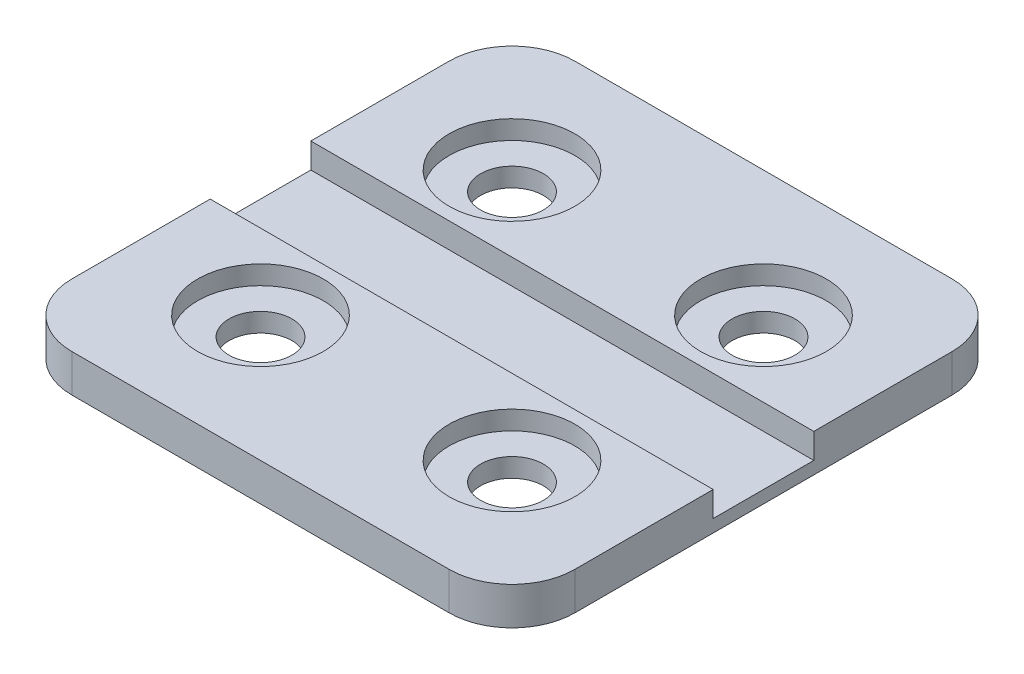
ISO-10303-21;
HEADER;
FILE_DESCRIPTION(('STEP AP214'),'2;1');
FILE_NAME('part.step','',(''),(''),'','','');
FILE_SCHEMA(('AUTOMOTIVE_DESIGN { 1 0 10303 214 1 1 1 1 }'));
ENDSEC;
DATA;
#1=APPLICATION_CONTEXT('core data for automotive mechanical design processes');
#2=APPLICATION_PROTOCOL_DEFINITION('international standard','automotive_design',2000,#1);
#3=PRODUCT_CONTEXT('',#1,'mechanical');
#4=PRODUCT('Part','Part','',(#3));
#5=PRODUCT_RELATED_PRODUCT_CATEGORY('part','',(#4));
#6=PRODUCT_DEFINITION_FORMATION('','',#4);
#7=PRODUCT_DEFINITION_CONTEXT('part definition',#1,'design');
#8=PRODUCT_DEFINITION('design','',#6,#7);
#9=PRODUCT_DEFINITION_SHAPE('','',#8);
#10=(LENGTH_UNIT() NAMED_UNIT(*) SI_UNIT(.MILLI.,.METRE.));
#11=(NAMED_UNIT(*) PLANE_ANGLE_UNIT() SI_UNIT($,.RADIAN.));
#12=(NAMED_UNIT(*) SI_UNIT($,.STERADIAN.) SOLID_ANGLE_UNIT());
#13=UNCERTAINTY_MEASURE_WITH_UNIT(LENGTH_MEASURE(1.E-05),#10,'distance_accuracy_value','');
#14=(GEOMETRIC_REPRESENTATION_CONTEXT(3) GLOBAL_UNCERTAINTY_ASSIGNED_CONTEXT((#13)) GLOBAL_UNIT_ASSIGNED_CONTEXT((#10,
#11,#12)) REPRESENTATION_CONTEXT('',''));
#15=CARTESIAN_POINT('',(0.,0.,0.));
#16=DIRECTION('',(0.,0.,1.));
#17=DIRECTION('',(1.,0.,0.));
#18=AXIS2_PLACEMENT_3D('',#15,#16,#17);
#19=CARTESIAN_POINT('',(0.,3.,0.));
#20=DIRECTION('',(0.,-1.,0.));
#21=DIRECTION('',(0.,0.,-1.));
#22=AXIS2_PLACEMENT_3D('',#19,#20,#21);
#23=PLANE('',#22);
#24=CARTESIAN_POINT('',(10.,3.,10.));
#25=DIRECTION('',(0.,1.,0.));
#26=DIRECTION('',(0.,0.,1.));
#27=AXIS2_PLACEMENT_3D('',#24,#25,#26);
#28=CIRCLE('',#27,5.);
#29=CARTESIAN_POINT('',(10.,3.,15.));
#30=VERTEX_POINT('',#29);
#31=EDGE_CURVE('E200',#30,#30,#28,.T.);
#32=ORIENTED_EDGE('',*,*,#31,.F.);
#33=EDGE_LOOP('',(#32));
#34=FACE_BOUND('',#33,.T.);
#35=CARTESIAN_POINT('',(-10.,3.,10.));
#36=DIRECTION('',(0.,1.,0.));
#37=DIRECTION('',(0.,0.,1.));
#38=AXIS2_PLACEMENT_3D('',#35,#36,#37);
#39=CIRCLE('',#38,5.);
#40=CARTESIAN_POINT('',(-10.,3.,15.));
#41=VERTEX_POINT('',#40);
#42=EDGE_CURVE('E208',#41,#41,#39,.T.);
#43=ORIENTED_EDGE('',*,*,#42,.F.);
#44=EDGE_LOOP('',(#43));
#45=FACE_BOUND('',#44,.T.);
#46=DIRECTION('',(0.,0.,-1.));
#47=VECTOR('',#46,1.);
#48=CARTESIAN_POINT('',(20.,3.,20.));
#49=LINE('',#48,#47);
#50=CARTESIAN_POINT('',(20.,3.,15.));
#51=VERTEX_POINT('',#50);
#52=CARTESIAN_POINT('',(20.,3.,4.));
#53=VERTEX_POINT('',#52);
#54=EDGE_CURVE('E236',#51,#53,#49,.T.);
#55=ORIENTED_EDGE('',*,*,#54,.T.);
#56=DIRECTION('',(1.,0.,0.));
#57=VECTOR('',#56,1.);
#58=CARTESIAN_POINT('',(-20.,3.,4.));
#59=LINE('',#58,#57);
#60=CARTESIAN_POINT('',(-20.,3.,4.));
#61=VERTEX_POINT('',#60);
#62=EDGE_CURVE('E136',#61,#53,#59,.T.);
#63=ORIENTED_EDGE('',*,*,#62,.F.);
#64=DIRECTION('',(0.,0.,1.));
#65=VECTOR('',#64,1.);
#66=CARTESIAN_POINT('',(-20.,3.,20.));
#67=LINE('',#66,#65);
#68=CARTESIAN_POINT('',(-20.,3.,15.));
#69=VERTEX_POINT('',#68);
#70=EDGE_CURVE('E243',#61,#69,#67,.T.);
#71=ORIENTED_EDGE('',*,*,#70,.T.);
#72=CARTESIAN_POINT('',(-15.,3.,15.));
#73=DIRECTION('',(0.,-1.,0.));
#74=DIRECTION('',(0.,0.,-1.));
#75=AXIS2_PLACEMENT_3D('',#72,#73,#74);
#76=CIRCLE('',#75,5.);
#77=CARTESIAN_POINT('',(-15.,3.,20.));
#78=VERTEX_POINT('',#77);
#79=EDGE_CURVE('E302',#69,#78,#76,.F.);
#80=ORIENTED_EDGE('',*,*,#79,.T.);
#81=DIRECTION('',(1.,0.,0.));
#82=VECTOR('',#81,1.);
#83=CARTESIAN_POINT('',(-20.,3.,20.));
#84=LINE('',#83,#82);
#85=CARTESIAN_POINT('',(15.,3.,20.));
#86=VERTEX_POINT('',#85);
#87=EDGE_CURVE('E248',#78,#86,#84,.T.);
#88=ORIENTED_EDGE('',*,*,#87,.T.);
#89=CARTESIAN_POINT('',(15.,3.,15.));
#90=DIRECTION('',(0.,-1.,0.));
#91=DIRECTION('',(0.,0.,-1.));
#92=AXIS2_PLACEMENT_3D('',#89,#90,#91);
#93=CIRCLE('',#92,5.);
#94=EDGE_CURVE('E299',#86,#51,#93,.F.);
#95=ORIENTED_EDGE('',*,*,#94,.T.);
#96=EDGE_LOOP('',(#55,#63,#71,#80,#88,#95));
#97=FACE_BOUND('',#96,.T.);
#98=ADVANCED_FACE('F40',(#34,#45,#97),#23,.F.);
#99=CARTESIAN_POINT('',(20.,3.,20.));
#100=DIRECTION('',(-1.,0.,0.));
#101=DIRECTION('',(0.,0.,1.));
#102=AXIS2_PLACEMENT_3D('',#99,#100,#101);
#103=PLANE('',#102);
#104=DIRECTION('',(0.,0.,-1.));
#105=VECTOR('',#104,1.);
#106=CARTESIAN_POINT('',(20.,1.,-4.));
#107=LINE('',#106,#105);
#108=CARTESIAN_POINT('',(20.,1.,4.));
#109=VERTEX_POINT('',#108);
#110=CARTESIAN_POINT('',(20.,1.,-4.));
#111=VERTEX_POINT('',#110);
#112=EDGE_CURVE('E142',#109,#111,#107,.T.);
#113=ORIENTED_EDGE('',*,*,#112,.F.);
#114=DIRECTION('',(0.,1.,0.));
#115=VECTOR('',#114,1.);
#116=CARTESIAN_POINT('',(20.,-40.7921561087423,4.));
#117=LINE('',#116,#115);
#118=EDGE_CURVE('E130',#109,#53,#117,.T.);
#119=ORIENTED_EDGE('',*,*,#118,.T.);
#120=ORIENTED_EDGE('',*,*,#54,.F.);
#121=DIRECTION('',(0.,-1.,0.));
#122=VECTOR('',#121,1.);
#123=CARTESIAN_POINT('',(20.,3.,15.));
#124=LINE('',#123,#122);
#125=CARTESIAN_POINT('',(20.,0.,15.));
#126=VERTEX_POINT('',#125);
#127=EDGE_CURVE('E309',#51,#126,#124,.T.);
#128=ORIENTED_EDGE('',*,*,#127,.T.);
#129=DIRECTION('',(0.,0.,-1.));
#130=VECTOR('',#129,1.);
#131=CARTESIAN_POINT('',(20.,0.,20.));
#132=LINE('',#131,#130);
#133=CARTESIAN_POINT('',(20.,0.,-15.));
#134=VERTEX_POINT('',#133);
#135=EDGE_CURVE('E232',#126,#134,#132,.T.);
#136=ORIENTED_EDGE('',*,*,#135,.T.);
#137=DIRECTION('',(0.,-1.,0.));
#138=VECTOR('',#137,1.);
#139=CARTESIAN_POINT('',(20.,3.,-15.));
#140=LINE('',#139,#138);
#141=CARTESIAN_POINT('',(20.,3.,-15.));
#142=VERTEX_POINT('',#141);
#143=EDGE_CURVE('E305',#134,#142,#140,.F.);
#144=ORIENTED_EDGE('',*,*,#143,.T.);
#145=CARTESIAN_POINT('',(20.,3.,-4.));
#146=VERTEX_POINT('',#145);
#147=EDGE_CURVE('E240',#146,#142,#49,.T.);
#148=ORIENTED_EDGE('',*,*,#147,.F.);
#149=DIRECTION('',(0.,1.,0.));
#150=VECTOR('',#149,1.);
#151=CARTESIAN_POINT('',(20.,-40.7921561087423,-4.));
#152=LINE('',#151,#150);
#153=EDGE_CURVE('E56',#111,#146,#152,.T.);
#154=ORIENTED_EDGE('',*,*,#153,.F.);
#155=EDGE_LOOP('',(#113,#119,#120,#128,#136,#144,#148,#154));
#156=FACE_BOUND('',#155,.T.);
#157=ADVANCED_FACE('F154',(#156),#103,.F.);
#158=CARTESIAN_POINT('',(-20.,3.,-20.));
#159=DIRECTION('',(0.,0.,1.));
#160=DIRECTION('',(1.,0.,0.));
#161=AXIS2_PLACEMENT_3D('',#158,#159,#160);
#162=PLANE('',#161);
#163=DIRECTION('',(-1.,0.,0.));
#164=VECTOR('',#163,1.);
#165=CARTESIAN_POINT('',(-20.,3.,-20.));
#166=LINE('',#165,#164);
#167=CARTESIAN_POINT('',(15.,3.,-20.));
#168=VERTEX_POINT('',#167);
#169=CARTESIAN_POINT('',(-15.,3.,-20.));
#170=VERTEX_POINT('',#169);
#171=EDGE_CURVE('E239',#168,#170,#166,.T.);
#172=ORIENTED_EDGE('',*,*,#171,.F.);
#173=DIRECTION('',(0.,-1.,0.));
#174=VECTOR('',#173,1.);
#175=CARTESIAN_POINT('',(15.,3.,-20.));
#176=LINE('',#175,#174);
#177=CARTESIAN_POINT('',(15.,0.,-20.));
#178=VERTEX_POINT('',#177);
#179=EDGE_CURVE('E12',#168,#178,#176,.T.);
#180=ORIENTED_EDGE('',*,*,#179,.T.);
#181=DIRECTION('',(-1.,0.,0.));
#182=VECTOR('',#181,1.);
#183=CARTESIAN_POINT('',(-20.,0.,-20.));
#184=LINE('',#183,#182);
#185=CARTESIAN_POINT('',(-15.,0.,-20.));
#186=VERTEX_POINT('',#185);
#187=EDGE_CURVE('E256',#178,#186,#184,.T.);
#188=ORIENTED_EDGE('',*,*,#187,.T.);
#189=DIRECTION('',(0.,-1.,0.));
#190=VECTOR('',#189,1.);
#191=CARTESIAN_POINT('',(-15.,3.,-20.));
#192=LINE('',#191,#190);
#193=EDGE_CURVE('E49',#186,#170,#192,.F.);
#194=ORIENTED_EDGE('',*,*,#193,.T.);
#195=EDGE_LOOP('',(#172,#180,#188,#194));
#196=FACE_BOUND('',#195,.T.);
#197=ADVANCED_FACE('F336',(#196),#162,.F.);
#198=CARTESIAN_POINT('',(-20.,3.,20.));
#199=DIRECTION('',(1.,0.,0.));
#200=DIRECTION('',(0.,0.,-1.));
#201=AXIS2_PLACEMENT_3D('',#198,#199,#200);
#202=PLANE('',#201);
#203=ORIENTED_EDGE('',*,*,#70,.F.);
#204=DIRECTION('',(0.,1.,0.));
#205=VECTOR('',#204,1.);
#206=CARTESIAN_POINT('',(-20.,-40.7921561087423,4.));
#207=LINE('',#206,#205);
#208=CARTESIAN_POINT('',(-20.,1.,4.));
#209=VERTEX_POINT('',#208);
#210=EDGE_CURVE('E168',#209,#61,#207,.T.);
#211=ORIENTED_EDGE('',*,*,#210,.F.);
#212=DIRECTION('',(0.,0.,1.));
#213=VECTOR('',#212,1.);
#214=CARTESIAN_POINT('',(-20.,1.,-4.));
#215=LINE('',#214,#213);
#216=CARTESIAN_POINT('',(-20.,1.,-4.));
#217=VERTEX_POINT('',#216);
#218=EDGE_CURVE('E149',#217,#209,#215,.T.);
#219=ORIENTED_EDGE('',*,*,#218,.F.);
#220=DIRECTION('',(0.,1.,0.));
#221=VECTOR('',#220,1.);
#222=CARTESIAN_POINT('',(-20.,-40.7921561087423,-4.));
#223=LINE('',#222,#221);
#224=CARTESIAN_POINT('',(-20.,3.,-4.));
#225=VERTEX_POINT('',#224);
#226=EDGE_CURVE('E164',#217,#225,#223,.T.);
#227=ORIENTED_EDGE('',*,*,#226,.T.);
#228=CARTESIAN_POINT('',(-20.,3.,-15.));
#229=VERTEX_POINT('',#228);
#230=EDGE_CURVE('E244',#229,#225,#67,.T.);
#231=ORIENTED_EDGE('',*,*,#230,.F.);
#232=DIRECTION('',(0.,-1.,0.));
#233=VECTOR('',#232,1.);
#234=CARTESIAN_POINT('',(-20.,3.,-15.));
#235=LINE('',#234,#233);
#236=CARTESIAN_POINT('',(-20.,0.,-15.));
#237=VERTEX_POINT('',#236);
#238=EDGE_CURVE('E285',#229,#237,#235,.T.);
#239=ORIENTED_EDGE('',*,*,#238,.T.);
#240=DIRECTION('',(0.,0.,1.));
#241=VECTOR('',#240,1.);
#242=CARTESIAN_POINT('',(-20.,0.,20.));
#243=LINE('',#242,#241);
#244=CARTESIAN_POINT('',(-20.,0.,15.));
#245=VERTEX_POINT('',#244);
#246=EDGE_CURVE('E259',#237,#245,#243,.T.);
#247=ORIENTED_EDGE('',*,*,#246,.T.);
#248=DIRECTION('',(0.,-1.,0.));
#249=VECTOR('',#248,1.);
#250=CARTESIAN_POINT('',(-20.,3.,15.));
#251=LINE('',#250,#249);
#252=EDGE_CURVE('E289',#245,#69,#251,.F.);
#253=ORIENTED_EDGE('',*,*,#252,.T.);
#254=EDGE_LOOP('',(#203,#211,#219,#227,#231,#239,#247,#253));
#255=FACE_BOUND('',#254,.T.);
#256=ADVANCED_FACE('F319',(#255),#202,.F.);
#257=CARTESIAN_POINT('',(-20.,3.,20.));
#258=DIRECTION('',(0.,0.,-1.));
#259=DIRECTION('',(-1.,0.,0.));
#260=AXIS2_PLACEMENT_3D('',#257,#258,#259);
#261=PLANE('',#260);
#262=ORIENTED_EDGE('',*,*,#87,.F.);
#263=DIRECTION('',(0.,-1.,0.));
#264=VECTOR('',#263,1.);
#265=CARTESIAN_POINT('',(-15.,3.,20.));
#266=LINE('',#265,#264);
#267=CARTESIAN_POINT('',(-15.,0.,20.));
#268=VERTEX_POINT('',#267);
#269=EDGE_CURVE('E269',#78,#268,#266,.T.);
#270=ORIENTED_EDGE('',*,*,#269,.T.);
#271=DIRECTION('',(1.,0.,0.));
#272=VECTOR('',#271,1.);
#273=CARTESIAN_POINT('',(-20.,0.,20.));
#274=LINE('',#273,#272);
#275=CARTESIAN_POINT('',(15.,0.,20.));
#276=VERTEX_POINT('',#275);
#277=EDGE_CURVE('E263',#268,#276,#274,.T.);
#278=ORIENTED_EDGE('',*,*,#277,.T.);
#279=DIRECTION('',(0.,-1.,0.));
#280=VECTOR('',#279,1.);
#281=CARTESIAN_POINT('',(15.,3.,20.));
#282=LINE('',#281,#280);
#283=EDGE_CURVE('E252',#276,#86,#282,.F.);
#284=ORIENTED_EDGE('',*,*,#283,.T.);
#285=EDGE_LOOP('',(#262,#270,#278,#284));
#286=FACE_BOUND('',#285,.T.);
#287=ADVANCED_FACE('F352',(#286),#261,.F.);
#288=CARTESIAN_POINT('',(10.,3.,-10.));
#289=DIRECTION('',(0.,1.,0.));
#290=DIRECTION('',(0.,0.,1.));
#291=AXIS2_PLACEMENT_3D('',#288,#289,#290);
#292=CIRCLE('',#291,5.);
#293=CARTESIAN_POINT('',(10.,3.,-5.));
#294=VERTEX_POINT('',#293);
#295=EDGE_CURVE('E217',#294,#294,#292,.T.);
#296=ORIENTED_EDGE('',*,*,#295,.F.);
#297=EDGE_LOOP('',(#296));
#298=FACE_BOUND('',#297,.T.);
#299=CARTESIAN_POINT('',(-10.,3.,-10.));
#300=DIRECTION('',(0.,1.,0.));
#301=DIRECTION('',(0.,0.,1.));
#302=AXIS2_PLACEMENT_3D('',#299,#300,#301);
#303=CIRCLE('',#302,5.);
#304=CARTESIAN_POINT('',(-10.,3.,-5.));
#305=VERTEX_POINT('',#304);
#306=EDGE_CURVE('E216',#305,#305,#303,.T.);
#307=ORIENTED_EDGE('',*,*,#306,.F.);
#308=EDGE_LOOP('',(#307));
#309=FACE_BOUND('',#308,.T.);
#310=ORIENTED_EDGE('',*,*,#230,.T.);
#311=DIRECTION('',(-1.,0.,0.));
#312=VECTOR('',#311,1.);
#313=CARTESIAN_POINT('',(-20.,3.,-4.));
#314=LINE('',#313,#312);
#315=EDGE_CURVE('E152',#146,#225,#314,.T.);
#316=ORIENTED_EDGE('',*,*,#315,.F.);
#317=ORIENTED_EDGE('',*,*,#147,.T.);
#318=CARTESIAN_POINT('',(15.,3.,-15.));
#319=DIRECTION('',(0.,-1.,0.));
#320=DIRECTION('',(0.,0.,-1.));
#321=AXIS2_PLACEMENT_3D('',#318,#319,#320);
#322=CIRCLE('',#321,5.);
#323=EDGE_CURVE('E296',#142,#168,#322,.F.);
#324=ORIENTED_EDGE('',*,*,#323,.T.);
#325=ORIENTED_EDGE('',*,*,#171,.T.);
#326=CARTESIAN_POINT('',(-15.,3.,-15.));
#327=DIRECTION('',(0.,-1.,0.));
#328=DIRECTION('',(0.,0.,-1.));
#329=AXIS2_PLACEMENT_3D('',#326,#327,#328);
#330=CIRCLE('',#329,5.);
#331=EDGE_CURVE('E293',#170,#229,#330,.F.);
#332=ORIENTED_EDGE('',*,*,#331,.T.);
#333=EDGE_LOOP('',(#310,#316,#317,#324,#325,#332));
#334=FACE_BOUND('',#333,.T.);
#335=ADVANCED_FACE('F328',(#298,#309,#334),#23,.F.);
#336=CARTESIAN_POINT('',(0.,0.,0.));
#337=DIRECTION('',(0.,-1.,0.));
#338=DIRECTION('',(0.,0.,-1.));
#339=AXIS2_PLACEMENT_3D('',#336,#337,#338);
#340=PLANE('',#339);
#341=CARTESIAN_POINT('',(10.,0.,-10.));
#342=DIRECTION('',(0.,1.,0.));
#343=DIRECTION('',(0.,0.,1.));
#344=AXIS2_PLACEMENT_3D('',#341,#342,#343);
#345=CIRCLE('',#344,2.5);
#346=CARTESIAN_POINT('',(10.,0.,-7.5));
#347=VERTEX_POINT('',#346);
#348=EDGE_CURVE('E180',#347,#347,#345,.T.);
#349=ORIENTED_EDGE('',*,*,#348,.T.);
#350=EDGE_LOOP('',(#349));
#351=FACE_BOUND('',#350,.T.);
#352=CARTESIAN_POINT('',(-10.,0.,10.));
#353=DIRECTION('',(0.,1.,0.));
#354=DIRECTION('',(0.,0.,1.));
#355=AXIS2_PLACEMENT_3D('',#352,#353,#354);
#356=CIRCLE('',#355,2.5);
#357=CARTESIAN_POINT('',(-10.,0.,12.5));
#358=VERTEX_POINT('',#357);
#359=EDGE_CURVE('E189',#358,#358,#356,.T.);
#360=ORIENTED_EDGE('',*,*,#359,.T.);
#361=EDGE_LOOP('',(#360));
#362=FACE_BOUND('',#361,.T.);
#363=CARTESIAN_POINT('',(10.,0.,10.));
#364=DIRECTION('',(0.,1.,0.));
#365=DIRECTION('',(0.,0.,1.));
#366=AXIS2_PLACEMENT_3D('',#363,#364,#365);
#367=CIRCLE('',#366,2.5);
#368=CARTESIAN_POINT('',(10.,0.,12.5));
#369=VERTEX_POINT('',#368);
#370=EDGE_CURVE('E172',#369,#369,#367,.T.);
#371=ORIENTED_EDGE('',*,*,#370,.T.);
#372=EDGE_LOOP('',(#371));
#373=FACE_BOUND('',#372,.T.);
#374=CARTESIAN_POINT('',(-10.,0.,-10.));
#375=DIRECTION('',(0.,1.,0.));
#376=DIRECTION('',(0.,0.,1.));
#377=AXIS2_PLACEMENT_3D('',#374,#375,#376);
#378=CIRCLE('',#377,2.5);
#379=CARTESIAN_POINT('',(-10.,0.,-7.5));
#380=VERTEX_POINT('',#379);
#381=EDGE_CURVE('E196',#380,#380,#378,.T.);
#382=ORIENTED_EDGE('',*,*,#381,.T.);
#383=EDGE_LOOP('',(#382));
#384=FACE_BOUND('',#383,.T.);
#385=ORIENTED_EDGE('',*,*,#277,.F.);
#386=CARTESIAN_POINT('',(-15.,0.,15.));
#387=DIRECTION('',(0.,-1.,0.));
#388=DIRECTION('',(0.,0.,-1.));
#389=AXIS2_PLACEMENT_3D('',#386,#387,#388);
#390=CIRCLE('',#389,5.);
#391=EDGE_CURVE('E282',#268,#245,#390,.T.);
#392=ORIENTED_EDGE('',*,*,#391,.T.);
#393=ORIENTED_EDGE('',*,*,#246,.F.);
#394=CARTESIAN_POINT('',(-15.,0.,-15.));
#395=DIRECTION('',(0.,-1.,0.));
#396=DIRECTION('',(0.,0.,-1.));
#397=AXIS2_PLACEMENT_3D('',#394,#395,#396);
#398=CIRCLE('',#397,5.);
#399=EDGE_CURVE('E273',#237,#186,#398,.T.);
#400=ORIENTED_EDGE('',*,*,#399,.T.);
#401=ORIENTED_EDGE('',*,*,#187,.F.);
#402=CARTESIAN_POINT('',(15.,0.,-15.));
#403=DIRECTION('',(0.,-1.,0.));
#404=DIRECTION('',(0.,0.,-1.));
#405=AXIS2_PLACEMENT_3D('',#402,#403,#404);
#406=CIRCLE('',#405,5.);
#407=EDGE_CURVE('E276',#178,#134,#406,.T.);
#408=ORIENTED_EDGE('',*,*,#407,.T.);
#409=ORIENTED_EDGE('',*,*,#135,.F.);
#410=CARTESIAN_POINT('',(15.,0.,15.));
#411=DIRECTION('',(0.,-1.,0.));
#412=DIRECTION('',(0.,0.,-1.));
#413=AXIS2_PLACEMENT_3D('',#410,#411,#412);
#414=CIRCLE('',#413,5.);
#415=EDGE_CURVE('E279',#126,#276,#414,.T.);
#416=ORIENTED_EDGE('',*,*,#415,.T.);
#417=EDGE_LOOP('',(#385,#392,#393,#400,#401,#408,#409,#416));
#418=FACE_BOUND('',#417,.T.);
#419=ADVANCED_FACE('F340',(#351,#362,#373,#384,#418),#340,.T.);
#420=CARTESIAN_POINT('',(-10.,1.5,-10.));
#421=DIRECTION('',(0.,1.,0.));
#422=DIRECTION('',(0.,0.,1.));
#423=AXIS2_PLACEMENT_3D('',#420,#421,#422);
#424=CYLINDRICAL_SURFACE('',#423,5.);
#425=CARTESIAN_POINT('',(-10.,1.5,-10.));
#426=DIRECTION('',(0.,1.,0.));
#427=DIRECTION('',(0.,0.,1.));
#428=AXIS2_PLACEMENT_3D('',#425,#426,#427);
#429=CIRCLE('',#428,5.);
#430=CARTESIAN_POINT('',(-10.,1.5,-5.));
#431=VERTEX_POINT('',#430);
#432=EDGE_CURVE('E228',#431,#431,#429,.T.);
#433=ORIENTED_EDGE('',*,*,#432,.F.);
#434=EDGE_LOOP('',(#433));
#435=FACE_BOUND('',#434,.T.);
#436=ORIENTED_EDGE('',*,*,#306,.T.);
#437=EDGE_LOOP('',(#436));
#438=FACE_BOUND('',#437,.T.);
#439=ADVANCED_FACE('F384',(#435,#438),#424,.F.);
#440=CARTESIAN_POINT('',(0.,1.5,0.));
#441=DIRECTION('',(0.,1.,0.));
#442=DIRECTION('',(0.,0.,1.));
#443=AXIS2_PLACEMENT_3D('',#440,#441,#442);
#444=PLANE('',#443);
#445=CARTESIAN_POINT('',(-10.,1.5,-10.));
#446=DIRECTION('',(0.,1.,0.));
#447=DIRECTION('',(0.,0.,1.));
#448=AXIS2_PLACEMENT_3D('',#445,#446,#447);
#449=CIRCLE('',#448,2.5);
#450=CARTESIAN_POINT('',(-10.,1.5,-7.5));
#451=VERTEX_POINT('',#450);
#452=EDGE_CURVE('E184',#451,#451,#449,.T.);
#453=ORIENTED_EDGE('',*,*,#452,.F.);
#454=EDGE_LOOP('',(#453));
#455=FACE_BOUND('',#454,.T.);
#456=ORIENTED_EDGE('',*,*,#432,.T.);
#457=EDGE_LOOP('',(#456));
#458=FACE_BOUND('',#457,.T.);
#459=ADVANCED_FACE('F393',(#455,#458),#444,.T.);
#460=CARTESIAN_POINT('',(10.,1.5,10.));
#461=DIRECTION('',(0.,1.,0.));
#462=DIRECTION('',(0.,0.,1.));
#463=AXIS2_PLACEMENT_3D('',#460,#461,#462);
#464=CYLINDRICAL_SURFACE('',#463,5.);
#465=CARTESIAN_POINT('',(10.,1.5,10.));
#466=DIRECTION('',(0.,1.,0.));
#467=DIRECTION('',(0.,0.,1.));
#468=AXIS2_PLACEMENT_3D('',#465,#466,#467);
#469=CIRCLE('',#468,5.);
#470=CARTESIAN_POINT('',(10.,1.5,15.));
#471=VERTEX_POINT('',#470);
#472=EDGE_CURVE('E204',#471,#471,#469,.T.);
#473=ORIENTED_EDGE('',*,*,#472,.F.);
#474=EDGE_LOOP('',(#473));
#475=FACE_BOUND('',#474,.T.);
#476=ORIENTED_EDGE('',*,*,#31,.T.);
#477=EDGE_LOOP('',(#476));
#478=FACE_BOUND('',#477,.T.);
#479=ADVANCED_FACE('F398',(#475,#478),#464,.F.);
#480=CARTESIAN_POINT('',(0.,1.5,0.));
#481=DIRECTION('',(0.,1.,0.));
#482=DIRECTION('',(0.,0.,1.));
#483=AXIS2_PLACEMENT_3D('',#480,#481,#482);
#484=PLANE('',#483);
#485=CARTESIAN_POINT('',(10.,1.5,10.));
#486=DIRECTION('',(0.,1.,0.));
#487=DIRECTION('',(0.,0.,1.));
#488=AXIS2_PLACEMENT_3D('',#485,#486,#487);
#489=CIRCLE('',#488,2.5);
#490=CARTESIAN_POINT('',(10.,1.5,12.5));
#491=VERTEX_POINT('',#490);
#492=EDGE_CURVE('E171',#491,#491,#489,.T.);
#493=ORIENTED_EDGE('',*,*,#492,.F.);
#494=EDGE_LOOP('',(#493));
#495=FACE_BOUND('',#494,.T.);
#496=ORIENTED_EDGE('',*,*,#472,.T.);
#497=EDGE_LOOP('',(#496));
#498=FACE_BOUND('',#497,.T.);
#499=ADVANCED_FACE('F407',(#495,#498),#484,.T.);
#500=CARTESIAN_POINT('',(-10.,1.5,10.));
#501=DIRECTION('',(0.,1.,0.));
#502=DIRECTION('',(0.,0.,1.));
#503=AXIS2_PLACEMENT_3D('',#500,#501,#502);
#504=CYLINDRICAL_SURFACE('',#503,5.);
#505=CARTESIAN_POINT('',(-10.,1.5,10.));
#506=DIRECTION('',(0.,1.,0.));
#507=DIRECTION('',(0.,0.,1.));
#508=AXIS2_PLACEMENT_3D('',#505,#506,#507);
#509=CIRCLE('',#508,5.);
#510=CARTESIAN_POINT('',(-10.,1.5,15.));
#511=VERTEX_POINT('',#510);
#512=EDGE_CURVE('E221',#511,#511,#509,.T.);
#513=ORIENTED_EDGE('',*,*,#512,.F.);
#514=EDGE_LOOP('',(#513));
#515=FACE_BOUND('',#514,.T.);
#516=ORIENTED_EDGE('',*,*,#42,.T.);
#517=EDGE_LOOP('',(#516));
#518=FACE_BOUND('',#517,.T.);
#519=ADVANCED_FACE('F403',(#515,#518),#504,.F.);
#520=CARTESIAN_POINT('',(0.,1.5,0.));
#521=DIRECTION('',(0.,1.,0.));
#522=DIRECTION('',(0.,0.,1.));
#523=AXIS2_PLACEMENT_3D('',#520,#521,#522);
#524=PLANE('',#523);
#525=CARTESIAN_POINT('',(-10.,1.5,10.));
#526=DIRECTION('',(0.,1.,0.));
#527=DIRECTION('',(0.,0.,1.));
#528=AXIS2_PLACEMENT_3D('',#525,#526,#527);
#529=CIRCLE('',#528,2.5);
#530=CARTESIAN_POINT('',(-10.,1.5,12.5));
#531=VERTEX_POINT('',#530);
#532=EDGE_CURVE('E176',#531,#531,#529,.T.);
#533=ORIENTED_EDGE('',*,*,#532,.F.);
#534=EDGE_LOOP('',(#533));
#535=FACE_BOUND('',#534,.T.);
#536=ORIENTED_EDGE('',*,*,#512,.T.);
#537=EDGE_LOOP('',(#536));
#538=FACE_BOUND('',#537,.T.);
#539=ADVANCED_FACE('F406',(#535,#538),#524,.T.);
#540=CARTESIAN_POINT('',(10.,1.5,-10.));
#541=DIRECTION('',(0.,1.,0.));
#542=DIRECTION('',(0.,0.,1.));
#543=AXIS2_PLACEMENT_3D('',#540,#541,#542);
#544=CYLINDRICAL_SURFACE('',#543,5.);
#545=CARTESIAN_POINT('',(10.,1.5,-10.));
#546=DIRECTION('',(0.,1.,0.));
#547=DIRECTION('',(0.,0.,1.));
#548=AXIS2_PLACEMENT_3D('',#545,#546,#547);
#549=CIRCLE('',#548,5.);
#550=CARTESIAN_POINT('',(10.,1.5,-5.));
#551=VERTEX_POINT('',#550);
#552=EDGE_CURVE('E212',#551,#551,#549,.T.);
#553=ORIENTED_EDGE('',*,*,#552,.F.);
#554=EDGE_LOOP('',(#553));
#555=FACE_BOUND('',#554,.T.);
#556=ORIENTED_EDGE('',*,*,#295,.T.);
#557=EDGE_LOOP('',(#556));
#558=FACE_BOUND('',#557,.T.);
#559=ADVANCED_FACE('F411',(#555,#558),#544,.F.);
#560=CARTESIAN_POINT('',(0.,1.5,0.));
#561=DIRECTION('',(0.,1.,0.));
#562=DIRECTION('',(0.,0.,1.));
#563=AXIS2_PLACEMENT_3D('',#560,#561,#562);
#564=PLANE('',#563);
#565=CARTESIAN_POINT('',(10.,1.5,-10.));
#566=DIRECTION('',(0.,1.,0.));
#567=DIRECTION('',(0.,0.,1.));
#568=AXIS2_PLACEMENT_3D('',#565,#566,#567);
#569=CIRCLE('',#568,2.5);
#570=CARTESIAN_POINT('',(10.,1.5,-7.5));
#571=VERTEX_POINT('',#570);
#572=EDGE_CURVE('E185',#571,#571,#569,.T.);
#573=ORIENTED_EDGE('',*,*,#572,.F.);
#574=EDGE_LOOP('',(#573));
#575=FACE_BOUND('',#574,.T.);
#576=ORIENTED_EDGE('',*,*,#552,.T.);
#577=EDGE_LOOP('',(#576));
#578=FACE_BOUND('',#577,.T.);
#579=ADVANCED_FACE('F415',(#575,#578),#564,.T.);
#580=CARTESIAN_POINT('',(-10.,0.,-10.));
#581=DIRECTION('',(0.,1.,0.));
#582=DIRECTION('',(0.,0.,1.));
#583=AXIS2_PLACEMENT_3D('',#580,#581,#582);
#584=CYLINDRICAL_SURFACE('',#583,2.5);
#585=ORIENTED_EDGE('',*,*,#381,.F.);
#586=EDGE_LOOP('',(#585));
#587=FACE_BOUND('',#586,.T.);
#588=ORIENTED_EDGE('',*,*,#452,.T.);
#589=EDGE_LOOP('',(#588));
#590=FACE_BOUND('',#589,.T.);
#591=ADVANCED_FACE('F419',(#587,#590),#584,.F.);
#592=CARTESIAN_POINT('',(10.,0.,10.));
#593=DIRECTION('',(0.,1.,0.));
#594=DIRECTION('',(0.,0.,1.));
#595=AXIS2_PLACEMENT_3D('',#592,#593,#594);
#596=CYLINDRICAL_SURFACE('',#595,2.5);
#597=ORIENTED_EDGE('',*,*,#370,.F.);
#598=EDGE_LOOP('',(#597));
#599=FACE_BOUND('',#598,.T.);
#600=ORIENTED_EDGE('',*,*,#492,.T.);
#601=EDGE_LOOP('',(#600));
#602=FACE_BOUND('',#601,.T.);
#603=ADVANCED_FACE('F429',(#599,#602),#596,.F.);
#604=CARTESIAN_POINT('',(-10.,0.,10.));
#605=DIRECTION('',(0.,1.,0.));
#606=DIRECTION('',(0.,0.,1.));
#607=AXIS2_PLACEMENT_3D('',#604,#605,#606);
#608=CYLINDRICAL_SURFACE('',#607,2.5);
#609=ORIENTED_EDGE('',*,*,#359,.F.);
#610=EDGE_LOOP('',(#609));
#611=FACE_BOUND('',#610,.T.);
#612=ORIENTED_EDGE('',*,*,#532,.T.);
#613=EDGE_LOOP('',(#612));
#614=FACE_BOUND('',#613,.T.);
#615=ADVANCED_FACE('F431',(#611,#614),#608,.F.);
#616=CARTESIAN_POINT('',(10.,0.,-10.));
#617=DIRECTION('',(0.,1.,0.));
#618=DIRECTION('',(0.,0.,1.));
#619=AXIS2_PLACEMENT_3D('',#616,#617,#618);
#620=CYLINDRICAL_SURFACE('',#619,2.5);
#621=ORIENTED_EDGE('',*,*,#348,.F.);
#622=EDGE_LOOP('',(#621));
#623=FACE_BOUND('',#622,.T.);
#624=ORIENTED_EDGE('',*,*,#572,.T.);
#625=EDGE_LOOP('',(#624));
#626=FACE_BOUND('',#625,.T.);
#627=ADVANCED_FACE('F363',(#623,#626),#620,.F.);
#628=CARTESIAN_POINT('',(-15.,3.,15.));
#629=DIRECTION('',(0.,-1.,0.));
#630=DIRECTION('',(0.,0.,-1.));
#631=AXIS2_PLACEMENT_3D('',#628,#629,#630);
#632=CYLINDRICAL_SURFACE('',#631,5.);
#633=ORIENTED_EDGE('',*,*,#79,.F.);
#634=ORIENTED_EDGE('',*,*,#252,.F.);
#635=ORIENTED_EDGE('',*,*,#391,.F.);
#636=ORIENTED_EDGE('',*,*,#269,.F.);
#637=EDGE_LOOP('',(#633,#634,#635,#636));
#638=FACE_BOUND('',#637,.T.);
#639=ADVANCED_FACE('F347',(#638),#632,.T.);
#640=CARTESIAN_POINT('',(15.,3.,15.));
#641=DIRECTION('',(0.,-1.,0.));
#642=DIRECTION('',(0.,0.,-1.));
#643=AXIS2_PLACEMENT_3D('',#640,#641,#642);
#644=CYLINDRICAL_SURFACE('',#643,5.);
#645=ORIENTED_EDGE('',*,*,#94,.F.);
#646=ORIENTED_EDGE('',*,*,#283,.F.);
#647=ORIENTED_EDGE('',*,*,#415,.F.);
#648=ORIENTED_EDGE('',*,*,#127,.F.);
#649=EDGE_LOOP('',(#645,#646,#647,#648));
#650=FACE_BOUND('',#649,.T.);
#651=ADVANCED_FACE('F355',(#650),#644,.T.);
#652=CARTESIAN_POINT('',(15.,3.,-15.));
#653=DIRECTION('',(0.,-1.,0.));
#654=DIRECTION('',(0.,0.,-1.));
#655=AXIS2_PLACEMENT_3D('',#652,#653,#654);
#656=CYLINDRICAL_SURFACE('',#655,5.);
#657=ORIENTED_EDGE('',*,*,#323,.F.);
#658=ORIENTED_EDGE('',*,*,#143,.F.);
#659=ORIENTED_EDGE('',*,*,#407,.F.);
#660=ORIENTED_EDGE('',*,*,#179,.F.);
#661=EDGE_LOOP('',(#657,#658,#659,#660));
#662=FACE_BOUND('',#661,.T.);
#663=ADVANCED_FACE('F334',(#662),#656,.T.);
#664=CARTESIAN_POINT('',(-15.,3.,-15.));
#665=DIRECTION('',(0.,-1.,0.));
#666=DIRECTION('',(0.,0.,-1.));
#667=AXIS2_PLACEMENT_3D('',#664,#665,#666);
#668=CYLINDRICAL_SURFACE('',#667,5.);
#669=ORIENTED_EDGE('',*,*,#331,.F.);
#670=ORIENTED_EDGE('',*,*,#193,.F.);
#671=ORIENTED_EDGE('',*,*,#399,.F.);
#672=ORIENTED_EDGE('',*,*,#238,.F.);
#673=EDGE_LOOP('',(#669,#670,#671,#672));
#674=FACE_BOUND('',#673,.T.);
#675=ADVANCED_FACE('F42',(#674),#668,.T.);
#676=CARTESIAN_POINT('',(0.,1.,0.));
#677=DIRECTION('',(0.,-1.,0.));
#678=DIRECTION('',(0.,0.,-1.));
#679=AXIS2_PLACEMENT_3D('',#676,#677,#678);
#680=PLANE('',#679);
#681=ORIENTED_EDGE('',*,*,#218,.T.);
#682=DIRECTION('',(1.,0.,0.));
#683=VECTOR('',#682,1.);
#684=CARTESIAN_POINT('',(-20.,1.,4.));
#685=LINE('',#684,#683);
#686=EDGE_CURVE('E133',#209,#109,#685,.T.);
#687=ORIENTED_EDGE('',*,*,#686,.T.);
#688=ORIENTED_EDGE('',*,*,#112,.T.);
#689=DIRECTION('',(-1.,0.,0.));
#690=VECTOR('',#689,1.);
#691=CARTESIAN_POINT('',(-20.,1.,-4.));
#692=LINE('',#691,#690);
#693=EDGE_CURVE('E159',#111,#217,#692,.T.);
#694=ORIENTED_EDGE('',*,*,#693,.T.);
#695=EDGE_LOOP('',(#681,#687,#688,#694));
#696=FACE_BOUND('',#695,.T.);
#697=ADVANCED_FACE('F146',(#696),#680,.F.);
#698=CARTESIAN_POINT('',(-20.,-40.7921561087423,4.));
#699=DIRECTION('',(0.,0.,1.));
#700=DIRECTION('',(1.,0.,0.));
#701=AXIS2_PLACEMENT_3D('',#698,#699,#700);
#702=PLANE('',#701);
#703=ORIENTED_EDGE('',*,*,#210,.T.);
#704=ORIENTED_EDGE('',*,*,#62,.T.);
#705=ORIENTED_EDGE('',*,*,#118,.F.);
#706=ORIENTED_EDGE('',*,*,#686,.F.);
#707=EDGE_LOOP('',(#703,#704,#705,#706));
#708=FACE_BOUND('',#707,.T.);
#709=ADVANCED_FACE('F132',(#708),#702,.F.);
#710=CARTESIAN_POINT('',(-20.,-40.7921561087423,-4.));
#711=DIRECTION('',(0.,0.,-1.));
#712=DIRECTION('',(-1.,0.,0.));
#713=AXIS2_PLACEMENT_3D('',#710,#711,#712);
#714=PLANE('',#713);
#715=ORIENTED_EDGE('',*,*,#153,.T.);
#716=ORIENTED_EDGE('',*,*,#315,.T.);
#717=ORIENTED_EDGE('',*,*,#226,.F.);
#718=ORIENTED_EDGE('',*,*,#693,.F.);
#719=EDGE_LOOP('',(#715,#716,#717,#718));
#720=FACE_BOUND('',#719,.T.);
#721=ADVANCED_FACE('F326',(#720),#714,.F.);
#722=CLOSED_SHELL('',(#98,#157,#197,#256,#287,#335,#419,#439,#459,#479,#499,#519,#539,#559,#579,
#591,#603,#615,#627,#639,#651,#663,#675,#697,#709,#721));
#723=MANIFOLD_SOLID_BREP('B2',#722);
#724=ADVANCED_BREP_SHAPE_REPRESENTATION('',(#18,#723),#14);
#725=SHAPE_DEFINITION_REPRESENTATION(#9,#724);
ENDSEC;
END-ISO-10303-21;
